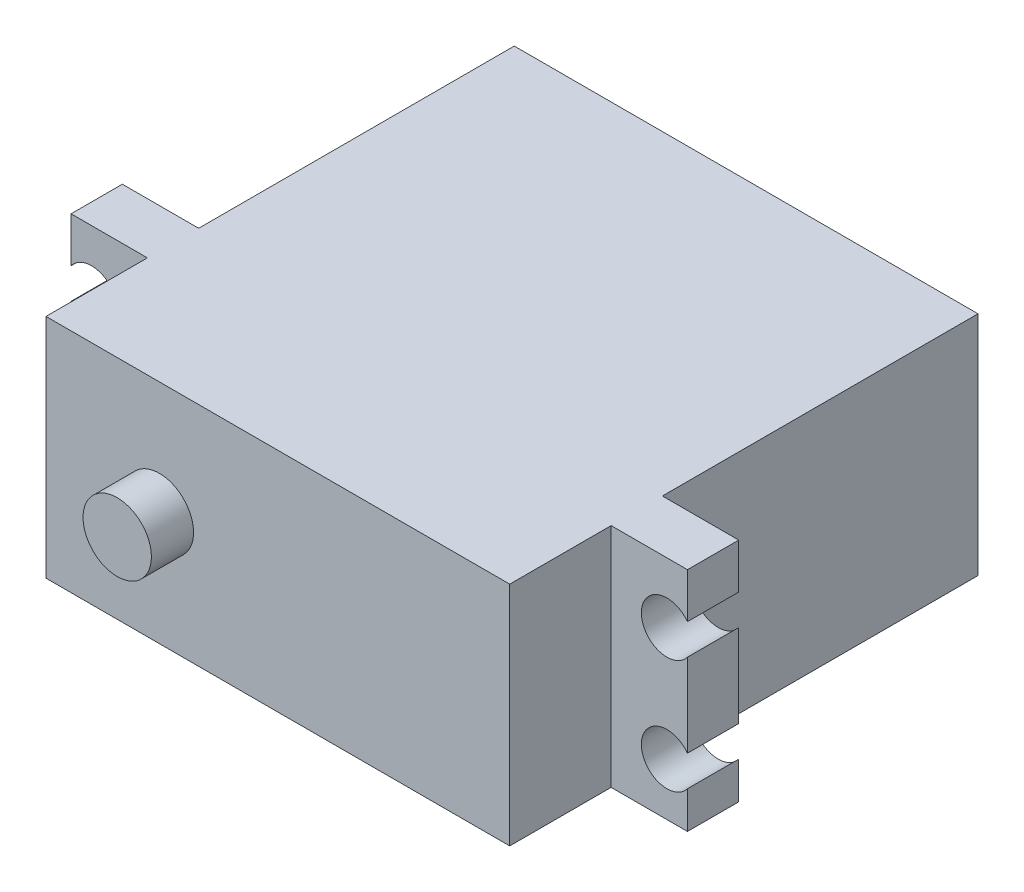
ISO-10303-21;
HEADER;
FILE_DESCRIPTION(('STEP AP214'),'2;1');
FILE_NAME('part.step','',(''),(''),'','','');
FILE_SCHEMA(('AUTOMOTIVE_DESIGN { 1 0 10303 214 1 1 1 1 }'));
ENDSEC;
DATA;
#1=APPLICATION_CONTEXT('core data for automotive mechanical design processes');
#2=APPLICATION_PROTOCOL_DEFINITION('international standard','automotive_design',2000,#1);
#3=PRODUCT_CONTEXT('',#1,'mechanical');
#4=PRODUCT('Part','Part','',(#3));
#5=PRODUCT_RELATED_PRODUCT_CATEGORY('part','',(#4));
#6=PRODUCT_DEFINITION_FORMATION('','',#4);
#7=PRODUCT_DEFINITION_CONTEXT('part definition',#1,'design');
#8=PRODUCT_DEFINITION('design','',#6,#7);
#9=PRODUCT_DEFINITION_SHAPE('','',#8);
#10=(LENGTH_UNIT() NAMED_UNIT(*) SI_UNIT(.MILLI.,.METRE.));
#11=(NAMED_UNIT(*) PLANE_ANGLE_UNIT() SI_UNIT($,.RADIAN.));
#12=(NAMED_UNIT(*) SI_UNIT($,.STERADIAN.) SOLID_ANGLE_UNIT());
#13=UNCERTAINTY_MEASURE_WITH_UNIT(LENGTH_MEASURE(1.E-05),#10,'distance_accuracy_value','');
#14=(GEOMETRIC_REPRESENTATION_CONTEXT(3) GLOBAL_UNCERTAINTY_ASSIGNED_CONTEXT((#13)) GLOBAL_UNIT_ASSIGNED_CONTEXT((#10,
#11,#12)) REPRESENTATION_CONTEXT('',''));
#15=CARTESIAN_POINT('',(0.,0.,0.));
#16=DIRECTION('',(0.,0.,1.));
#17=DIRECTION('',(1.,0.,0.));
#18=AXIS2_PLACEMENT_3D('',#15,#16,#17);
#19=CARTESIAN_POINT('',(-27.05,64.2368308155855,27.7));
#20=DIRECTION('',(-1.,0.,0.));
#21=DIRECTION('',(0.,0.,1.));
#22=AXIS2_PLACEMENT_3D('',#19,#20,#21);
#23=PLANE('',#22);
#24=DIRECTION('',(0.,0.,1.));
#25=VECTOR('',#24,1.);
#26=CARTESIAN_POINT('',(-27.05,-6.70018998686811,-0.001000000000001));
#27=LINE('',#26,#25);
#28=CARTESIAN_POINT('',(-27.05,-6.70018998686811,32.2));
#29=VERTEX_POINT('',#28);
#30=CARTESIAN_POINT('',(-27.05,-6.70018998686811,27.7));
#31=VERTEX_POINT('',#30);
#32=EDGE_CURVE('E61',#29,#31,#27,.F.);
#33=ORIENTED_EDGE('',*,*,#32,.T.);
#34=DIRECTION('',(0.,-1.,0.));
#35=VECTOR('',#34,1.);
#36=CARTESIAN_POINT('',(-27.05,64.2368308155855,27.7));
#37=LINE('',#36,#35);
#38=CARTESIAN_POINT('',(-27.05,-9.95,27.7));
#39=VERTEX_POINT('',#38);
#40=EDGE_CURVE('E307',#31,#39,#37,.T.);
#41=ORIENTED_EDGE('',*,*,#40,.T.);
#42=DIRECTION('',(0.,0.,-1.));
#43=VECTOR('',#42,1.);
#44=CARTESIAN_POINT('',(-27.05,-9.95,27.7));
#45=LINE('',#44,#43);
#46=CARTESIAN_POINT('',(-27.05,-9.95,32.2));
#47=VERTEX_POINT('',#46);
#48=EDGE_CURVE('E283',#47,#39,#45,.T.);
#49=ORIENTED_EDGE('',*,*,#48,.F.);
#50=DIRECTION('',(0.,-1.,0.));
#51=VECTOR('',#50,1.);
#52=CARTESIAN_POINT('',(-27.05,64.2368308155855,32.2));
#53=LINE('',#52,#51);
#54=EDGE_CURVE('E311',#29,#47,#53,.T.);
#55=ORIENTED_EDGE('',*,*,#54,.F.);
#56=EDGE_LOOP('',(#33,#41,#49,#55));
#57=FACE_BOUND('',#56,.T.);
#58=ADVANCED_FACE('F38',(#57),#23,.T.);
#59=DIRECTION('',(0.,0.,1.));
#60=VECTOR('',#59,1.);
#61=CARTESIAN_POINT('',(-27.05,-4.00018998686811,-0.001000000000001));
#62=LINE('',#61,#60);
#63=CARTESIAN_POINT('',(-27.05,-4.00018998686811,27.7));
#64=VERTEX_POINT('',#63);
#65=CARTESIAN_POINT('',(-27.05,-4.00018998686812,32.2));
#66=VERTEX_POINT('',#65);
#67=EDGE_CURVE('E253',#64,#66,#62,.T.);
#68=ORIENTED_EDGE('',*,*,#67,.T.);
#69=CARTESIAN_POINT('',(-27.05,3.29981001313189,32.2));
#70=VERTEX_POINT('',#69);
#71=EDGE_CURVE('E310',#70,#66,#53,.T.);
#72=ORIENTED_EDGE('',*,*,#71,.F.);
#73=DIRECTION('',(0.,0.,1.));
#74=VECTOR('',#73,1.);
#75=CARTESIAN_POINT('',(-27.05,3.29981001313189,-0.001000000000001));
#76=LINE('',#75,#74);
#77=CARTESIAN_POINT('',(-27.05,3.29981001313189,27.7));
#78=VERTEX_POINT('',#77);
#79=EDGE_CURVE('E275',#70,#78,#76,.F.);
#80=ORIENTED_EDGE('',*,*,#79,.T.);
#81=EDGE_CURVE('E325',#78,#64,#37,.T.);
#82=ORIENTED_EDGE('',*,*,#81,.T.);
#83=EDGE_LOOP('',(#68,#72,#80,#82));
#84=FACE_BOUND('',#83,.T.);
#85=ADVANCED_FACE('F409',(#84),#23,.T.);
#86=CARTESIAN_POINT('',(27.05,64.2368308155855,27.7));
#87=DIRECTION('',(1.,0.,0.));
#88=DIRECTION('',(0.,0.,-1.));
#89=AXIS2_PLACEMENT_3D('',#86,#87,#88);
#90=PLANE('',#89);
#91=DIRECTION('',(0.,0.,1.));
#92=VECTOR('',#91,1.);
#93=CARTESIAN_POINT('',(27.05,5.99981001313189,-0.001000000000001));
#94=LINE('',#93,#92);
#95=CARTESIAN_POINT('',(27.05,5.99981001313189,32.2));
#96=VERTEX_POINT('',#95);
#97=CARTESIAN_POINT('',(27.05,5.99981001313189,27.7));
#98=VERTEX_POINT('',#97);
#99=EDGE_CURVE('E266',#96,#98,#94,.F.);
#100=ORIENTED_EDGE('',*,*,#99,.T.);
#101=DIRECTION('',(0.,-1.,0.));
#102=VECTOR('',#101,1.);
#103=CARTESIAN_POINT('',(27.05,64.2368308155855,27.7));
#104=LINE('',#103,#102);
#105=CARTESIAN_POINT('',(27.05,9.95,27.7));
#106=VERTEX_POINT('',#105);
#107=EDGE_CURVE('E317',#106,#98,#104,.T.);
#108=ORIENTED_EDGE('',*,*,#107,.F.);
#109=DIRECTION('',(0.,0.,-1.));
#110=VECTOR('',#109,1.);
#111=CARTESIAN_POINT('',(27.05,9.95,27.7));
#112=LINE('',#111,#110);
#113=CARTESIAN_POINT('',(27.05,9.95,32.2));
#114=VERTEX_POINT('',#113);
#115=EDGE_CURVE('E284',#114,#106,#112,.T.);
#116=ORIENTED_EDGE('',*,*,#115,.F.);
#117=DIRECTION('',(0.,-1.,0.));
#118=VECTOR('',#117,1.);
#119=CARTESIAN_POINT('',(27.05,64.2368308155855,32.2));
#120=LINE('',#119,#118);
#121=EDGE_CURVE('E312',#114,#96,#120,.T.);
#122=ORIENTED_EDGE('',*,*,#121,.T.);
#123=EDGE_LOOP('',(#100,#108,#116,#122));
#124=FACE_BOUND('',#123,.T.);
#125=ADVANCED_FACE('F442',(#124),#90,.T.);
#126=DIRECTION('',(0.,0.,1.));
#127=VECTOR('',#126,1.);
#128=CARTESIAN_POINT('',(27.05,3.29981001313189,-0.001000000000001));
#129=LINE('',#128,#127);
#130=CARTESIAN_POINT('',(27.05,3.29981001313189,27.7));
#131=VERTEX_POINT('',#130);
#132=CARTESIAN_POINT('',(27.05,3.29981001313189,32.2));
#133=VERTEX_POINT('',#132);
#134=EDGE_CURVE('E252',#131,#133,#129,.T.);
#135=ORIENTED_EDGE('',*,*,#134,.T.);
#136=CARTESIAN_POINT('',(27.05,-4.00018998686811,32.2));
#137=VERTEX_POINT('',#136);
#138=EDGE_CURVE('E315',#133,#137,#120,.T.);
#139=ORIENTED_EDGE('',*,*,#138,.T.);
#140=DIRECTION('',(0.,0.,1.));
#141=VECTOR('',#140,1.);
#142=CARTESIAN_POINT('',(27.05,-4.00018998686811,-0.001000000000001));
#143=LINE('',#142,#141);
#144=CARTESIAN_POINT('',(27.05,-4.00018998686812,27.7));
#145=VERTEX_POINT('',#144);
#146=EDGE_CURVE('E244',#137,#145,#143,.F.);
#147=ORIENTED_EDGE('',*,*,#146,.T.);
#148=EDGE_CURVE('E320',#131,#145,#104,.T.);
#149=ORIENTED_EDGE('',*,*,#148,.F.);
#150=EDGE_LOOP('',(#135,#139,#147,#149));
#151=FACE_BOUND('',#150,.T.);
#152=ADVANCED_FACE('F473',(#151),#90,.T.);
#153=CARTESIAN_POINT('',(20.35,-9.95,41.1));
#154=DIRECTION('',(-1.,0.,0.));
#155=DIRECTION('',(0.,0.,1.));
#156=AXIS2_PLACEMENT_3D('',#153,#154,#155);
#157=PLANE('',#156);
#158=DIRECTION('',(0.,0.,-1.));
#159=VECTOR('',#158,1.);
#160=CARTESIAN_POINT('',(20.35,-9.95,41.1));
#161=LINE('',#160,#159);
#162=CARTESIAN_POINT('',(20.35,-9.95,41.1));
#163=VERTEX_POINT('',#162);
#164=CARTESIAN_POINT('',(20.35,-9.95,32.2));
#165=VERTEX_POINT('',#164);
#166=EDGE_CURVE('E361',#163,#165,#161,.T.);
#167=ORIENTED_EDGE('',*,*,#166,.T.);
#168=DIRECTION('',(0.,1.,0.));
#169=VECTOR('',#168,1.);
#170=CARTESIAN_POINT('',(20.35,-9.95,32.2));
#171=LINE('',#170,#169);
#172=CARTESIAN_POINT('',(20.35,9.95,32.2));
#173=VERTEX_POINT('',#172);
#174=EDGE_CURVE('E336',#165,#173,#171,.T.);
#175=ORIENTED_EDGE('',*,*,#174,.T.);
#176=DIRECTION('',(0.,0.,-1.));
#177=VECTOR('',#176,1.);
#178=CARTESIAN_POINT('',(20.35,9.95,41.1));
#179=LINE('',#178,#177);
#180=CARTESIAN_POINT('',(20.35,9.95,41.1));
#181=VERTEX_POINT('',#180);
#182=EDGE_CURVE('E46',#181,#173,#179,.T.);
#183=ORIENTED_EDGE('',*,*,#182,.F.);
#184=DIRECTION('',(0.,1.,0.));
#185=VECTOR('',#184,1.);
#186=CARTESIAN_POINT('',(20.35,-9.95,41.1));
#187=LINE('',#186,#185);
#188=EDGE_CURVE('E340',#163,#181,#187,.T.);
#189=ORIENTED_EDGE('',*,*,#188,.F.);
#190=EDGE_LOOP('',(#167,#175,#183,#189));
#191=FACE_BOUND('',#190,.T.);
#192=ADVANCED_FACE('F467',(#191),#157,.F.);
#193=CARTESIAN_POINT('',(-20.35,-9.95,41.1));
#194=DIRECTION('',(1.,0.,0.));
#195=DIRECTION('',(0.,0.,-1.));
#196=AXIS2_PLACEMENT_3D('',#193,#194,#195);
#197=PLANE('',#196);
#198=DIRECTION('',(0.,0.,-1.));
#199=VECTOR('',#198,1.);
#200=CARTESIAN_POINT('',(-20.35,9.95,41.1));
#201=LINE('',#200,#199);
#202=CARTESIAN_POINT('',(-20.35,9.95,41.1));
#203=VERTEX_POINT('',#202);
#204=CARTESIAN_POINT('',(-20.35,9.95,32.2));
#205=VERTEX_POINT('',#204);
#206=EDGE_CURVE('E369',#203,#205,#201,.T.);
#207=ORIENTED_EDGE('',*,*,#206,.T.);
#208=DIRECTION('',(0.,-1.,0.));
#209=VECTOR('',#208,1.);
#210=CARTESIAN_POINT('',(-20.35,-9.95,32.2));
#211=LINE('',#210,#209);
#212=CARTESIAN_POINT('',(-20.35,-9.95,32.2));
#213=VERTEX_POINT('',#212);
#214=EDGE_CURVE('E334',#205,#213,#211,.T.);
#215=ORIENTED_EDGE('',*,*,#214,.T.);
#216=DIRECTION('',(0.,0.,-1.));
#217=VECTOR('',#216,1.);
#218=CARTESIAN_POINT('',(-20.35,-9.95,41.1));
#219=LINE('',#218,#217);
#220=CARTESIAN_POINT('',(-20.35,-9.95,41.1));
#221=VERTEX_POINT('',#220);
#222=EDGE_CURVE('E365',#221,#213,#219,.T.);
#223=ORIENTED_EDGE('',*,*,#222,.F.);
#224=DIRECTION('',(0.,-1.,0.));
#225=VECTOR('',#224,1.);
#226=CARTESIAN_POINT('',(-20.35,-9.95,41.1));
#227=LINE('',#226,#225);
#228=EDGE_CURVE('E346',#203,#221,#227,.T.);
#229=ORIENTED_EDGE('',*,*,#228,.F.);
#230=EDGE_LOOP('',(#207,#215,#223,#229));
#231=FACE_BOUND('',#230,.T.);
#232=ADVANCED_FACE('F462',(#231),#197,.F.);
#233=CARTESIAN_POINT('',(20.35,9.95,27.7));
#234=VERTEX_POINT('',#233);
#235=CARTESIAN_POINT('',(20.35,9.95,0.));
#236=VERTEX_POINT('',#235);
#237=EDGE_CURVE('E370',#234,#236,#179,.T.);
#238=ORIENTED_EDGE('',*,*,#237,.F.);
#239=DIRECTION('',(0.,-1.,0.));
#240=VECTOR('',#239,1.);
#241=CARTESIAN_POINT('',(20.35,-9.95,27.7));
#242=LINE('',#241,#240);
#243=CARTESIAN_POINT('',(20.35,-9.95,27.7));
#244=VERTEX_POINT('',#243);
#245=EDGE_CURVE('E331',#234,#244,#242,.T.);
#246=ORIENTED_EDGE('',*,*,#245,.T.);
#247=CARTESIAN_POINT('',(20.35,-9.95,0.));
#248=VERTEX_POINT('',#247);
#249=EDGE_CURVE('E350',#244,#248,#161,.T.);
#250=ORIENTED_EDGE('',*,*,#249,.T.);
#251=DIRECTION('',(0.,1.,0.));
#252=VECTOR('',#251,1.);
#253=CARTESIAN_POINT('',(20.35,-9.95,0.));
#254=LINE('',#253,#252);
#255=EDGE_CURVE('E339',#248,#236,#254,.T.);
#256=ORIENTED_EDGE('',*,*,#255,.T.);
#257=EDGE_LOOP('',(#238,#246,#250,#256));
#258=FACE_BOUND('',#257,.T.);
#259=ADVANCED_FACE('F40',(#258),#157,.F.);
#260=CARTESIAN_POINT('',(-20.35,9.95,41.1));
#261=DIRECTION('',(0.,-1.,0.));
#262=DIRECTION('',(0.,0.,-1.));
#263=AXIS2_PLACEMENT_3D('',#260,#261,#262);
#264=PLANE('',#263);
#265=CARTESIAN_POINT('',(-20.35,9.95,27.7));
#266=VERTEX_POINT('',#265);
#267=CARTESIAN_POINT('',(-20.35,9.95,0.));
#268=VERTEX_POINT('',#267);
#269=EDGE_CURVE('E368',#266,#268,#201,.T.);
#270=ORIENTED_EDGE('',*,*,#269,.F.);
#271=DIRECTION('',(-1.,0.,0.));
#272=VECTOR('',#271,1.);
#273=CARTESIAN_POINT('',(-27.05,9.95,27.7));
#274=LINE('',#273,#272);
#275=CARTESIAN_POINT('',(-27.05,9.95,27.7));
#276=VERTEX_POINT('',#275);
#277=EDGE_CURVE('E293',#266,#276,#274,.T.);
#278=ORIENTED_EDGE('',*,*,#277,.T.);
#279=DIRECTION('',(0.,0.,1.));
#280=VECTOR('',#279,1.);
#281=CARTESIAN_POINT('',(-27.05,9.95,27.7));
#282=LINE('',#281,#280);
#283=CARTESIAN_POINT('',(-27.05,9.95,32.2));
#284=VERTEX_POINT('',#283);
#285=EDGE_CURVE('E291',#276,#284,#282,.T.);
#286=ORIENTED_EDGE('',*,*,#285,.T.);
#287=DIRECTION('',(1.,0.,0.));
#288=VECTOR('',#287,1.);
#289=CARTESIAN_POINT('',(-27.05,9.95,32.2));
#290=LINE('',#289,#288);
#291=EDGE_CURVE('E288',#284,#205,#290,.T.);
#292=ORIENTED_EDGE('',*,*,#291,.T.);
#293=ORIENTED_EDGE('',*,*,#206,.F.);
#294=DIRECTION('',(-1.,0.,0.));
#295=VECTOR('',#294,1.);
#296=CARTESIAN_POINT('',(-20.35,9.95,41.1));
#297=LINE('',#296,#295);
#298=EDGE_CURVE('E343',#181,#203,#297,.T.);
#299=ORIENTED_EDGE('',*,*,#298,.F.);
#300=ORIENTED_EDGE('',*,*,#182,.T.);
#301=EDGE_CURVE('E286',#173,#114,#290,.T.);
#302=ORIENTED_EDGE('',*,*,#301,.T.);
#303=ORIENTED_EDGE('',*,*,#115,.T.);
#304=EDGE_CURVE('E326',#106,#234,#274,.T.);
#305=ORIENTED_EDGE('',*,*,#304,.T.);
#306=ORIENTED_EDGE('',*,*,#237,.T.);
#307=DIRECTION('',(-1.,0.,0.));
#308=VECTOR('',#307,1.);
#309=CARTESIAN_POINT('',(-20.35,9.95,0.));
#310=LINE('',#309,#308);
#311=EDGE_CURVE('E353',#236,#268,#310,.T.);
#312=ORIENTED_EDGE('',*,*,#311,.T.);
#313=EDGE_LOOP('',(#270,#278,#286,#292,#293,#299,#300,#302,#303,#305,#306,#312));
#314=FACE_BOUND('',#313,.T.);
#315=ADVANCED_FACE('F376',(#314),#264,.F.);
#316=DIRECTION('',(0.,0.,-1.));
#317=VECTOR('',#316,1.);
#318=CARTESIAN_POINT('',(-20.35,3.35,8.));
#319=LINE('',#318,#317);
#320=CARTESIAN_POINT('',(-20.35,3.35,8.));
#321=VERTEX_POINT('',#320);
#322=CARTESIAN_POINT('',(-20.35,3.35,3.5));
#323=VERTEX_POINT('',#322);
#324=EDGE_CURVE('E224',#321,#323,#319,.T.);
#325=ORIENTED_EDGE('',*,*,#324,.F.);
#326=DIRECTION('',(0.,-1.,0.));
#327=VECTOR('',#326,1.);
#328=CARTESIAN_POINT('',(-20.35,3.35,8.));
#329=LINE('',#328,#327);
#330=CARTESIAN_POINT('',(-20.35,-3.35,8.));
#331=VERTEX_POINT('',#330);
#332=EDGE_CURVE('E230',#321,#331,#329,.T.);
#333=ORIENTED_EDGE('',*,*,#332,.T.);
#334=DIRECTION('',(0.,0.,-1.));
#335=VECTOR('',#334,1.);
#336=CARTESIAN_POINT('',(-20.35,-3.35,8.));
#337=LINE('',#336,#335);
#338=CARTESIAN_POINT('',(-20.35,-3.35,3.5));
#339=VERTEX_POINT('',#338);
#340=EDGE_CURVE('E206',#331,#339,#337,.T.);
#341=ORIENTED_EDGE('',*,*,#340,.T.);
#342=DIRECTION('',(0.,-1.,0.));
#343=VECTOR('',#342,1.);
#344=CARTESIAN_POINT('',(-20.35,3.35,3.5));
#345=LINE('',#344,#343);
#346=EDGE_CURVE('E53',#323,#339,#345,.T.);
#347=ORIENTED_EDGE('',*,*,#346,.F.);
#348=EDGE_LOOP('',(#325,#333,#341,#347));
#349=FACE_BOUND('',#348,.T.);
#350=CARTESIAN_POINT('',(-20.35,-9.95,27.7));
#351=VERTEX_POINT('',#350);
#352=CARTESIAN_POINT('',(-20.35,-9.95,0.));
#353=VERTEX_POINT('',#352);
#354=EDGE_CURVE('E364',#351,#353,#219,.T.);
#355=ORIENTED_EDGE('',*,*,#354,.F.);
#356=DIRECTION('',(0.,1.,0.));
#357=VECTOR('',#356,1.);
#358=CARTESIAN_POINT('',(-20.35,-9.95,27.7));
#359=LINE('',#358,#357);
#360=EDGE_CURVE('E328',#351,#266,#359,.T.);
#361=ORIENTED_EDGE('',*,*,#360,.T.);
#362=ORIENTED_EDGE('',*,*,#269,.T.);
#363=DIRECTION('',(0.,-1.,0.));
#364=VECTOR('',#363,1.);
#365=CARTESIAN_POINT('',(-20.35,-9.95,0.));
#366=LINE('',#365,#364);
#367=EDGE_CURVE('E356',#268,#353,#366,.T.);
#368=ORIENTED_EDGE('',*,*,#367,.T.);
#369=EDGE_LOOP('',(#355,#361,#362,#368));
#370=FACE_BOUND('',#369,.T.);
#371=ADVANCED_FACE('F392',(#349,#370),#197,.F.);
#372=CARTESIAN_POINT('',(-20.35,-9.95,41.1));
#373=DIRECTION('',(0.,1.,0.));
#374=DIRECTION('',(0.,0.,1.));
#375=AXIS2_PLACEMENT_3D('',#372,#373,#374);
#376=PLANE('',#375);
#377=ORIENTED_EDGE('',*,*,#249,.F.);
#378=DIRECTION('',(1.,0.,0.));
#379=VECTOR('',#378,1.);
#380=CARTESIAN_POINT('',(-27.05,-9.95,27.7));
#381=LINE('',#380,#379);
#382=CARTESIAN_POINT('',(27.05,-9.95,27.7));
#383=VERTEX_POINT('',#382);
#384=EDGE_CURVE('E296',#244,#383,#381,.T.);
#385=ORIENTED_EDGE('',*,*,#384,.T.);
#386=DIRECTION('',(0.,0.,1.));
#387=VECTOR('',#386,1.);
#388=CARTESIAN_POINT('',(27.05,-9.95,27.7));
#389=LINE('',#388,#387);
#390=CARTESIAN_POINT('',(27.05,-9.95,32.2));
#391=VERTEX_POINT('',#390);
#392=EDGE_CURVE('E300',#383,#391,#389,.T.);
#393=ORIENTED_EDGE('',*,*,#392,.T.);
#394=DIRECTION('',(-1.,0.,0.));
#395=VECTOR('',#394,1.);
#396=CARTESIAN_POINT('',(-27.05,-9.95,32.2));
#397=LINE('',#396,#395);
#398=EDGE_CURVE('E304',#391,#165,#397,.T.);
#399=ORIENTED_EDGE('',*,*,#398,.T.);
#400=ORIENTED_EDGE('',*,*,#166,.F.);
#401=DIRECTION('',(1.,0.,0.));
#402=VECTOR('',#401,1.);
#403=CARTESIAN_POINT('',(-20.35,-9.95,41.1));
#404=LINE('',#403,#402);
#405=EDGE_CURVE('E348',#221,#163,#404,.T.);
#406=ORIENTED_EDGE('',*,*,#405,.F.);
#407=ORIENTED_EDGE('',*,*,#222,.T.);
#408=EDGE_CURVE('E303',#213,#47,#397,.T.);
#409=ORIENTED_EDGE('',*,*,#408,.T.);
#410=ORIENTED_EDGE('',*,*,#48,.T.);
#411=EDGE_CURVE('E297',#39,#351,#381,.T.);
#412=ORIENTED_EDGE('',*,*,#411,.T.);
#413=ORIENTED_EDGE('',*,*,#354,.T.);
#414=DIRECTION('',(1.,0.,0.));
#415=VECTOR('',#414,1.);
#416=CARTESIAN_POINT('',(-20.35,-9.95,0.));
#417=LINE('',#416,#415);
#418=EDGE_CURVE('E344',#353,#248,#417,.T.);
#419=ORIENTED_EDGE('',*,*,#418,.T.);
#420=EDGE_LOOP('',(#377,#385,#393,#399,#400,#406,#407,#409,#410,#412,#413,#419));
#421=FACE_BOUND('',#420,.T.);
#422=ADVANCED_FACE('F388',(#421),#376,.F.);
#423=CARTESIAN_POINT('',(0.,0.,41.1));
#424=DIRECTION('',(0.,0.,-1.));
#425=DIRECTION('',(-1.,0.,0.));
#426=AXIS2_PLACEMENT_3D('',#423,#424,#425);
#427=PLANE('',#426);
#428=CARTESIAN_POINT('',(-10.4,0.,41.1));
#429=DIRECTION('',(0.,0.,-1.));
#430=DIRECTION('',(-1.,0.,0.));
#431=AXIS2_PLACEMENT_3D('',#428,#429,#430);
#432=CIRCLE('',#431,3.);
#433=CARTESIAN_POINT('',(-13.4,0.,41.1));
#434=VERTEX_POINT('',#433);
#435=EDGE_CURVE('E11',#434,#434,#432,.F.);
#436=ORIENTED_EDGE('',*,*,#435,.F.);
#437=EDGE_LOOP('',(#436));
#438=FACE_BOUND('',#437,.T.);
#439=ORIENTED_EDGE('',*,*,#188,.T.);
#440=ORIENTED_EDGE('',*,*,#298,.T.);
#441=ORIENTED_EDGE('',*,*,#228,.T.);
#442=ORIENTED_EDGE('',*,*,#405,.T.);
#443=EDGE_LOOP('',(#439,#440,#441,#442));
#444=FACE_BOUND('',#443,.T.);
#445=ADVANCED_FACE('F451',(#438,#444),#427,.F.);
#446=CARTESIAN_POINT('',(0.,0.,0.));
#447=DIRECTION('',(0.,0.,-1.));
#448=DIRECTION('',(-1.,0.,0.));
#449=AXIS2_PLACEMENT_3D('',#446,#447,#448);
#450=PLANE('',#449);
#451=ORIENTED_EDGE('',*,*,#255,.F.);
#452=ORIENTED_EDGE('',*,*,#418,.F.);
#453=ORIENTED_EDGE('',*,*,#367,.F.);
#454=ORIENTED_EDGE('',*,*,#311,.F.);
#455=EDGE_LOOP('',(#451,#452,#453,#454));
#456=FACE_BOUND('',#455,.T.);
#457=ADVANCED_FACE('F383',(#456),#450,.T.);
#458=DIRECTION('',(0.,0.,1.));
#459=VECTOR('',#458,1.);
#460=CARTESIAN_POINT('',(-27.05,5.99981001313189,-0.001000000000001));
#461=LINE('',#460,#459);
#462=CARTESIAN_POINT('',(-27.05,5.99981001313189,27.7));
#463=VERTEX_POINT('',#462);
#464=CARTESIAN_POINT('',(-27.05,5.99981001313189,32.2));
#465=VERTEX_POINT('',#464);
#466=EDGE_CURVE('E263',#463,#465,#461,.T.);
#467=ORIENTED_EDGE('',*,*,#466,.T.);
#468=EDGE_CURVE('E287',#284,#465,#53,.T.);
#469=ORIENTED_EDGE('',*,*,#468,.F.);
#470=ORIENTED_EDGE('',*,*,#285,.F.);
#471=EDGE_CURVE('E322',#276,#463,#37,.T.);
#472=ORIENTED_EDGE('',*,*,#471,.T.);
#473=EDGE_LOOP('',(#467,#469,#470,#472));
#474=FACE_BOUND('',#473,.T.);
#475=ADVANCED_FACE('F400',(#474),#23,.T.);
#476=CARTESIAN_POINT('',(-27.05,64.2368308155855,27.7));
#477=DIRECTION('',(0.,0.,-1.));
#478=DIRECTION('',(-1.,0.,0.));
#479=AXIS2_PLACEMENT_3D('',#476,#477,#478);
#480=PLANE('',#479);
#481=CARTESIAN_POINT('',(-25.25,-5.35018998686811,27.7));
#482=DIRECTION('',(0.,0.,-1.));
#483=DIRECTION('',(-1.,0.,0.));
#484=AXIS2_PLACEMENT_3D('',#481,#482,#483);
#485=CIRCLE('',#484,2.25);
#486=EDGE_CURVE('E260',#31,#64,#485,.F.);
#487=ORIENTED_EDGE('',*,*,#486,.T.);
#488=ORIENTED_EDGE('',*,*,#81,.F.);
#489=CARTESIAN_POINT('',(-25.25,4.64981001313189,27.7));
#490=DIRECTION('',(0.,0.,-1.));
#491=DIRECTION('',(-1.,0.,0.));
#492=AXIS2_PLACEMENT_3D('',#489,#490,#491);
#493=CIRCLE('',#492,2.25);
#494=EDGE_CURVE('E280',#78,#463,#493,.F.);
#495=ORIENTED_EDGE('',*,*,#494,.T.);
#496=ORIENTED_EDGE('',*,*,#471,.F.);
#497=ORIENTED_EDGE('',*,*,#277,.F.);
#498=ORIENTED_EDGE('',*,*,#360,.F.);
#499=ORIENTED_EDGE('',*,*,#411,.F.);
#500=ORIENTED_EDGE('',*,*,#40,.F.);
#501=EDGE_LOOP('',(#487,#488,#495,#496,#497,#498,#499,#500));
#502=FACE_BOUND('',#501,.T.);
#503=ADVANCED_FACE('F401',(#502),#480,.T.);
#504=CARTESIAN_POINT('',(-27.05,64.2368308155855,32.2));
#505=DIRECTION('',(0.,0.,1.));
#506=DIRECTION('',(1.,0.,0.));
#507=AXIS2_PLACEMENT_3D('',#504,#505,#506);
#508=PLANE('',#507);
#509=CARTESIAN_POINT('',(-25.25,-5.35018998686811,32.2));
#510=DIRECTION('',(0.,0.,1.));
#511=DIRECTION('',(1.,0.,0.));
#512=AXIS2_PLACEMENT_3D('',#509,#510,#511);
#513=CIRCLE('',#512,2.25);
#514=EDGE_CURVE('E258',#29,#66,#513,.T.);
#515=ORIENTED_EDGE('',*,*,#514,.F.);
#516=ORIENTED_EDGE('',*,*,#54,.T.);
#517=ORIENTED_EDGE('',*,*,#408,.F.);
#518=ORIENTED_EDGE('',*,*,#214,.F.);
#519=ORIENTED_EDGE('',*,*,#291,.F.);
#520=ORIENTED_EDGE('',*,*,#468,.T.);
#521=CARTESIAN_POINT('',(-25.25,4.64981001313189,32.2));
#522=DIRECTION('',(0.,0.,1.));
#523=DIRECTION('',(1.,0.,0.));
#524=AXIS2_PLACEMENT_3D('',#521,#522,#523);
#525=CIRCLE('',#524,2.25);
#526=EDGE_CURVE('E278',#70,#465,#525,.T.);
#527=ORIENTED_EDGE('',*,*,#526,.F.);
#528=ORIENTED_EDGE('',*,*,#71,.T.);
#529=EDGE_LOOP('',(#515,#516,#517,#518,#519,#520,#527,#528));
#530=FACE_BOUND('',#529,.T.);
#531=ADVANCED_FACE('F415',(#530),#508,.T.);
#532=CARTESIAN_POINT('',(25.25,4.64981001313189,32.2));
#533=DIRECTION('',(0.,0.,1.));
#534=DIRECTION('',(1.,0.,0.));
#535=AXIS2_PLACEMENT_3D('',#532,#533,#534);
#536=CIRCLE('',#535,2.25);
#537=EDGE_CURVE('E269',#96,#133,#536,.T.);
#538=ORIENTED_EDGE('',*,*,#537,.F.);
#539=ORIENTED_EDGE('',*,*,#121,.F.);
#540=ORIENTED_EDGE('',*,*,#301,.F.);
#541=ORIENTED_EDGE('',*,*,#174,.F.);
#542=ORIENTED_EDGE('',*,*,#398,.F.);
#543=CARTESIAN_POINT('',(27.05,-6.70018998686811,32.2));
#544=VERTEX_POINT('',#543);
#545=EDGE_CURVE('E316',#544,#391,#120,.T.);
#546=ORIENTED_EDGE('',*,*,#545,.F.);
#547=CARTESIAN_POINT('',(25.25,-5.35018998686811,32.2));
#548=DIRECTION('',(0.,0.,1.));
#549=DIRECTION('',(1.,0.,0.));
#550=AXIS2_PLACEMENT_3D('',#547,#548,#549);
#551=CIRCLE('',#550,2.25);
#552=EDGE_CURVE('E247',#137,#544,#551,.T.);
#553=ORIENTED_EDGE('',*,*,#552,.F.);
#554=ORIENTED_EDGE('',*,*,#138,.F.);
#555=EDGE_LOOP('',(#538,#539,#540,#541,#542,#546,#553,#554));
#556=FACE_BOUND('',#555,.T.);
#557=ADVANCED_FACE('F488',(#556),#508,.T.);
#558=CARTESIAN_POINT('',(25.25,4.64981001313189,27.7));
#559=DIRECTION('',(0.,0.,-1.));
#560=DIRECTION('',(-1.,0.,0.));
#561=AXIS2_PLACEMENT_3D('',#558,#559,#560);
#562=CIRCLE('',#561,2.25);
#563=EDGE_CURVE('E256',#98,#131,#562,.F.);
#564=ORIENTED_EDGE('',*,*,#563,.T.);
#565=ORIENTED_EDGE('',*,*,#148,.T.);
#566=CARTESIAN_POINT('',(25.25,-5.35018998686811,27.7));
#567=DIRECTION('',(0.,0.,-1.));
#568=DIRECTION('',(-1.,0.,0.));
#569=AXIS2_PLACEMENT_3D('',#566,#567,#568);
#570=CIRCLE('',#569,2.25);
#571=CARTESIAN_POINT('',(27.05,-6.70018998686811,27.7));
#572=VERTEX_POINT('',#571);
#573=EDGE_CURVE('E249',#145,#572,#570,.F.);
#574=ORIENTED_EDGE('',*,*,#573,.T.);
#575=EDGE_CURVE('E321',#572,#383,#104,.T.);
#576=ORIENTED_EDGE('',*,*,#575,.T.);
#577=ORIENTED_EDGE('',*,*,#384,.F.);
#578=ORIENTED_EDGE('',*,*,#245,.F.);
#579=ORIENTED_EDGE('',*,*,#304,.F.);
#580=ORIENTED_EDGE('',*,*,#107,.T.);
#581=EDGE_LOOP('',(#564,#565,#574,#576,#577,#578,#579,#580));
#582=FACE_BOUND('',#581,.T.);
#583=ADVANCED_FACE('F450',(#582),#480,.T.);
#584=DIRECTION('',(0.,0.,1.));
#585=VECTOR('',#584,1.);
#586=CARTESIAN_POINT('',(27.05,-6.70018998686812,-0.001000000000001));
#587=LINE('',#586,#585);
#588=EDGE_CURVE('E241',#572,#544,#587,.T.);
#589=ORIENTED_EDGE('',*,*,#588,.T.);
#590=ORIENTED_EDGE('',*,*,#545,.T.);
#591=ORIENTED_EDGE('',*,*,#392,.F.);
#592=ORIENTED_EDGE('',*,*,#575,.F.);
#593=EDGE_LOOP('',(#589,#590,#591,#592));
#594=FACE_BOUND('',#593,.T.);
#595=ADVANCED_FACE('F480',(#594),#90,.T.);
#596=CARTESIAN_POINT('',(25.25,-5.35018998686811,-0.001000000000001));
#597=DIRECTION('',(0.,0.,1.));
#598=DIRECTION('',(1.,0.,0.));
#599=AXIS2_PLACEMENT_3D('',#596,#597,#598);
#600=CYLINDRICAL_SURFACE('',#599,2.25);
#601=ORIENTED_EDGE('',*,*,#552,.T.);
#602=ORIENTED_EDGE('',*,*,#588,.F.);
#603=ORIENTED_EDGE('',*,*,#573,.F.);
#604=ORIENTED_EDGE('',*,*,#146,.F.);
#605=EDGE_LOOP('',(#601,#602,#603,#604));
#606=FACE_BOUND('',#605,.T.);
#607=ADVANCED_FACE('F502',(#606),#600,.F.);
#608=CARTESIAN_POINT('',(25.25,4.64981001313189,-0.001000000000001));
#609=DIRECTION('',(0.,0.,1.));
#610=DIRECTION('',(1.,0.,0.));
#611=AXIS2_PLACEMENT_3D('',#608,#609,#610);
#612=CYLINDRICAL_SURFACE('',#611,2.25);
#613=ORIENTED_EDGE('',*,*,#537,.T.);
#614=ORIENTED_EDGE('',*,*,#134,.F.);
#615=ORIENTED_EDGE('',*,*,#563,.F.);
#616=ORIENTED_EDGE('',*,*,#99,.F.);
#617=EDGE_LOOP('',(#613,#614,#615,#616));
#618=FACE_BOUND('',#617,.T.);
#619=ADVANCED_FACE('F433',(#618),#612,.F.);
#620=CARTESIAN_POINT('',(-25.25,4.64981001313189,-0.001000000000001));
#621=DIRECTION('',(0.,0.,1.));
#622=DIRECTION('',(1.,0.,0.));
#623=AXIS2_PLACEMENT_3D('',#620,#621,#622);
#624=CYLINDRICAL_SURFACE('',#623,2.25);
#625=ORIENTED_EDGE('',*,*,#526,.T.);
#626=ORIENTED_EDGE('',*,*,#466,.F.);
#627=ORIENTED_EDGE('',*,*,#494,.F.);
#628=ORIENTED_EDGE('',*,*,#79,.F.);
#629=EDGE_LOOP('',(#625,#626,#627,#628));
#630=FACE_BOUND('',#629,.T.);
#631=ADVANCED_FACE('F405',(#630),#624,.F.);
#632=CARTESIAN_POINT('',(-25.25,-5.35018998686811,-0.001000000000001));
#633=DIRECTION('',(0.,0.,1.));
#634=DIRECTION('',(1.,0.,0.));
#635=AXIS2_PLACEMENT_3D('',#632,#633,#634);
#636=CYLINDRICAL_SURFACE('',#635,2.25);
#637=ORIENTED_EDGE('',*,*,#514,.T.);
#638=ORIENTED_EDGE('',*,*,#67,.F.);
#639=ORIENTED_EDGE('',*,*,#486,.F.);
#640=ORIENTED_EDGE('',*,*,#32,.F.);
#641=EDGE_LOOP('',(#637,#638,#639,#640));
#642=FACE_BOUND('',#641,.T.);
#643=ADVANCED_FACE('F422',(#642),#636,.F.);
#644=CARTESIAN_POINT('',(-10.4,0.,44.8));
#645=DIRECTION('',(0.,0.,-1.));
#646=DIRECTION('',(-1.,0.,0.));
#647=AXIS2_PLACEMENT_3D('',#644,#645,#646);
#648=CYLINDRICAL_SURFACE('',#647,3.);
#649=CARTESIAN_POINT('',(-10.4,0.,44.8));
#650=DIRECTION('',(0.,0.,1.));
#651=DIRECTION('',(1.,0.,0.));
#652=AXIS2_PLACEMENT_3D('',#649,#650,#651);
#653=CIRCLE('',#652,3.);
#654=CARTESIAN_POINT('',(-7.4,0.,44.8));
#655=VERTEX_POINT('',#654);
#656=EDGE_CURVE('E235',#655,#655,#653,.T.);
#657=ORIENTED_EDGE('',*,*,#656,.F.);
#658=EDGE_LOOP('',(#657));
#659=FACE_BOUND('',#658,.T.);
#660=ORIENTED_EDGE('',*,*,#435,.T.);
#661=EDGE_LOOP('',(#660));
#662=FACE_BOUND('',#661,.T.);
#663=ADVANCED_FACE('F424',(#659,#662),#648,.T.);
#664=CARTESIAN_POINT('',(-10.4,0.,44.8));
#665=DIRECTION('',(0.,0.,1.));
#666=DIRECTION('',(1.,0.,0.));
#667=AXIS2_PLACEMENT_3D('',#664,#665,#666);
#668=PLANE('',#667);
#669=ORIENTED_EDGE('',*,*,#656,.T.);
#670=EDGE_LOOP('',(#669));
#671=FACE_BOUND('',#670,.T.);
#672=ADVANCED_FACE('F430',(#671),#668,.T.);
#673=CARTESIAN_POINT('',(-25.85,3.35,8.));
#674=DIRECTION('',(0.,0.,1.));
#675=DIRECTION('',(0.,-1.,0.));
#676=AXIS2_PLACEMENT_3D('',#673,#674,#675);
#677=PLANE('',#676);
#678=ORIENTED_EDGE('',*,*,#332,.F.);
#679=DIRECTION('',(1.,0.,0.));
#680=VECTOR('',#679,1.);
#681=CARTESIAN_POINT('',(-25.85,3.35,8.));
#682=LINE('',#681,#680);
#683=CARTESIAN_POINT('',(-25.85,3.35,8.));
#684=VERTEX_POINT('',#683);
#685=EDGE_CURVE('E222',#684,#321,#682,.T.);
#686=ORIENTED_EDGE('',*,*,#685,.F.);
#687=DIRECTION('',(0.,-1.,0.));
#688=VECTOR('',#687,1.);
#689=CARTESIAN_POINT('',(-25.85,3.35,8.));
#690=LINE('',#689,#688);
#691=CARTESIAN_POINT('',(-25.85,-3.35,8.));
#692=VERTEX_POINT('',#691);
#693=EDGE_CURVE('E217',#684,#692,#690,.T.);
#694=ORIENTED_EDGE('',*,*,#693,.T.);
#695=DIRECTION('',(1.,0.,0.));
#696=VECTOR('',#695,1.);
#697=CARTESIAN_POINT('',(-25.85,-3.35,8.));
#698=LINE('',#697,#696);
#699=EDGE_CURVE('E201',#692,#331,#698,.T.);
#700=ORIENTED_EDGE('',*,*,#699,.T.);
#701=EDGE_LOOP('',(#678,#686,#694,#700));
#702=FACE_BOUND('',#701,.T.);
#703=ADVANCED_FACE('F221',(#702),#677,.T.);
#704=CARTESIAN_POINT('',(-25.85,3.35,8.));
#705=DIRECTION('',(0.,-1.,0.));
#706=DIRECTION('',(0.,0.,-1.));
#707=AXIS2_PLACEMENT_3D('',#704,#705,#706);
#708=PLANE('',#707);
#709=ORIENTED_EDGE('',*,*,#324,.T.);
#710=DIRECTION('',(1.,0.,0.));
#711=VECTOR('',#710,1.);
#712=CARTESIAN_POINT('',(-25.85,3.35,3.5));
#713=LINE('',#712,#711);
#714=CARTESIAN_POINT('',(-25.85,3.35,3.5));
#715=VERTEX_POINT('',#714);
#716=EDGE_CURVE('E236',#715,#323,#713,.T.);
#717=ORIENTED_EDGE('',*,*,#716,.F.);
#718=DIRECTION('',(0.,0.,-1.));
#719=VECTOR('',#718,1.);
#720=CARTESIAN_POINT('',(-25.85,3.35,8.));
#721=LINE('',#720,#719);
#722=EDGE_CURVE('E212',#684,#715,#721,.T.);
#723=ORIENTED_EDGE('',*,*,#722,.F.);
#724=ORIENTED_EDGE('',*,*,#685,.T.);
#725=EDGE_LOOP('',(#709,#717,#723,#724));
#726=FACE_BOUND('',#725,.T.);
#727=ADVANCED_FACE('F579',(#726),#708,.F.);
#728=CARTESIAN_POINT('',(-25.85,3.35,3.5));
#729=DIRECTION('',(0.,0.,1.));
#730=DIRECTION('',(0.,-1.,0.));
#731=AXIS2_PLACEMENT_3D('',#728,#729,#730);
#732=PLANE('',#731);
#733=ORIENTED_EDGE('',*,*,#346,.T.);
#734=DIRECTION('',(1.,0.,0.));
#735=VECTOR('',#734,1.);
#736=CARTESIAN_POINT('',(-25.85,-3.35,3.5));
#737=LINE('',#736,#735);
#738=CARTESIAN_POINT('',(-25.85,-3.35,3.5));
#739=VERTEX_POINT('',#738);
#740=EDGE_CURVE('E211',#739,#339,#737,.T.);
#741=ORIENTED_EDGE('',*,*,#740,.F.);
#742=DIRECTION('',(0.,-1.,0.));
#743=VECTOR('',#742,1.);
#744=CARTESIAN_POINT('',(-25.85,3.35,3.5));
#745=LINE('',#744,#743);
#746=EDGE_CURVE('E219',#715,#739,#745,.T.);
#747=ORIENTED_EDGE('',*,*,#746,.F.);
#748=ORIENTED_EDGE('',*,*,#716,.T.);
#749=EDGE_LOOP('',(#733,#741,#747,#748));
#750=FACE_BOUND('',#749,.T.);
#751=ADVANCED_FACE('F588',(#750),#732,.F.);
#752=CARTESIAN_POINT('',(-25.85,-3.35,8.));
#753=DIRECTION('',(0.,-1.,0.));
#754=DIRECTION('',(0.,0.,-1.));
#755=AXIS2_PLACEMENT_3D('',#752,#753,#754);
#756=PLANE('',#755);
#757=ORIENTED_EDGE('',*,*,#340,.F.);
#758=ORIENTED_EDGE('',*,*,#699,.F.);
#759=DIRECTION('',(0.,0.,-1.));
#760=VECTOR('',#759,1.);
#761=CARTESIAN_POINT('',(-25.85,-3.35,8.));
#762=LINE('',#761,#760);
#763=EDGE_CURVE('E204',#692,#739,#762,.T.);
#764=ORIENTED_EDGE('',*,*,#763,.T.);
#765=ORIENTED_EDGE('',*,*,#740,.T.);
#766=EDGE_LOOP('',(#757,#758,#764,#765));
#767=FACE_BOUND('',#766,.T.);
#768=ADVANCED_FACE('F203',(#767),#756,.T.);
#769=CARTESIAN_POINT('',(-25.85,0.,0.));
#770=DIRECTION('',(1.,0.,0.));
#771=DIRECTION('',(0.,0.,-1.));
#772=AXIS2_PLACEMENT_3D('',#769,#770,#771);
#773=PLANE('',#772);
#774=ORIENTED_EDGE('',*,*,#693,.F.);
#775=ORIENTED_EDGE('',*,*,#722,.T.);
#776=ORIENTED_EDGE('',*,*,#746,.T.);
#777=ORIENTED_EDGE('',*,*,#763,.F.);
#778=EDGE_LOOP('',(#774,#775,#776,#777));
#779=FACE_BOUND('',#778,.T.);
#780=ADVANCED_FACE('F216',(#779),#773,.F.);
#781=CLOSED_SHELL('',(#58,#85,#125,#152,#192,#232,#259,#315,#371,#422,#445,#457,#475,#503,#531,
#557,#583,#595,#607,#619,#631,#643,#663,#672,#703,#727,#751,#768,#780));
#782=MANIFOLD_SOLID_BREP('B2',#781);
#783=ADVANCED_BREP_SHAPE_REPRESENTATION('',(#18,#782),#14);
#784=SHAPE_DEFINITION_REPRESENTATION(#9,#783);
ENDSEC;
END-ISO-10303-21;
